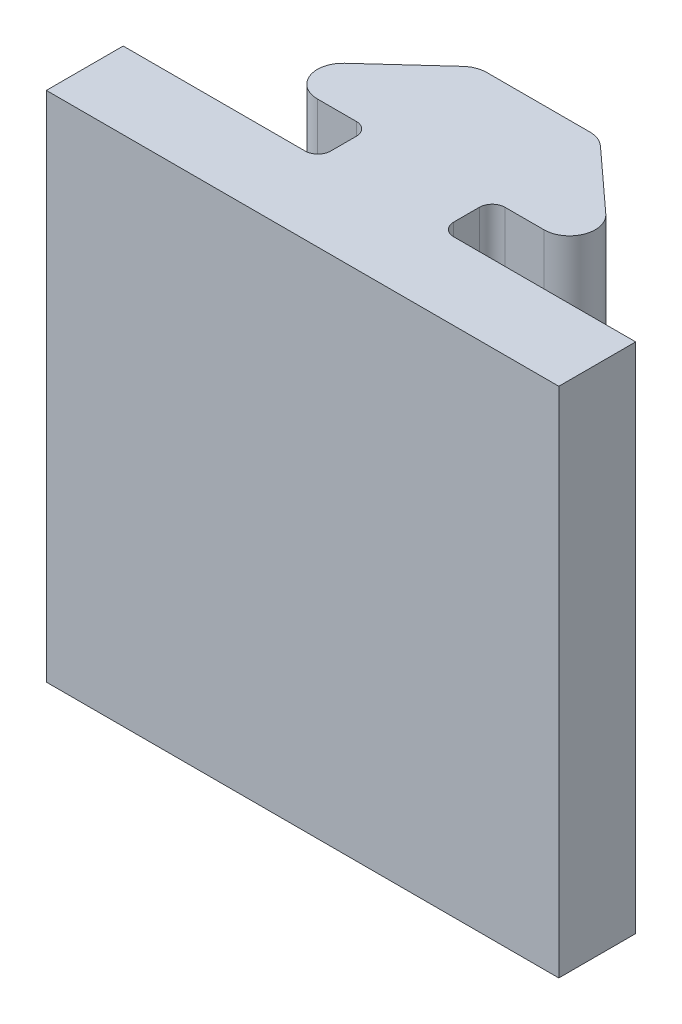
ISO-10303-21;
HEADER;
FILE_DESCRIPTION(('STEP AP214'),'2;1');
FILE_NAME('part.step','',(''),(''),'','','');
FILE_SCHEMA(('AUTOMOTIVE_DESIGN { 1 0 10303 214 1 1 1 1 }'));
ENDSEC;
DATA;
#1=APPLICATION_CONTEXT('core data for automotive mechanical design processes');
#2=APPLICATION_PROTOCOL_DEFINITION('international standard','automotive_design',2000,#1);
#3=PRODUCT_CONTEXT('',#1,'mechanical');
#4=PRODUCT('Part','Part','',(#3));
#5=PRODUCT_RELATED_PRODUCT_CATEGORY('part','',(#4));
#6=PRODUCT_DEFINITION_FORMATION('','',#4);
#7=PRODUCT_DEFINITION_CONTEXT('part definition',#1,'design');
#8=PRODUCT_DEFINITION('design','',#6,#7);
#9=PRODUCT_DEFINITION_SHAPE('','',#8);
#10=(LENGTH_UNIT() NAMED_UNIT(*) SI_UNIT(.MILLI.,.METRE.));
#11=(NAMED_UNIT(*) PLANE_ANGLE_UNIT() SI_UNIT($,.RADIAN.));
#12=(NAMED_UNIT(*) SI_UNIT($,.STERADIAN.) SOLID_ANGLE_UNIT());
#13=UNCERTAINTY_MEASURE_WITH_UNIT(LENGTH_MEASURE(1.E-05),#10,'distance_accuracy_value','');
#14=(GEOMETRIC_REPRESENTATION_CONTEXT(3) GLOBAL_UNCERTAINTY_ASSIGNED_CONTEXT((#13)) GLOBAL_UNIT_ASSIGNED_CONTEXT((#10,
#11,#12)) REPRESENTATION_CONTEXT('',''));
#15=CARTESIAN_POINT('',(0.,0.,0.));
#16=DIRECTION('',(0.,0.,1.));
#17=DIRECTION('',(1.,0.,0.));
#18=AXIS2_PLACEMENT_3D('',#15,#16,#17);
#19=CARTESIAN_POINT('',(2.4,20.,-4.58181818181819));
#20=DIRECTION('',(-0.674269364021332,0.,0.738485493928126));
#21=DIRECTION('',(0.738485493928126,0.,0.674269364021332));
#22=AXIS2_PLACEMENT_3D('',#19,#20,#21);
#23=PLANE('',#22);
#24=DIRECTION('',(-0.738485493928126,0.,-0.674269364021332));
#25=VECTOR('',#24,1.);
#26=CARTESIAN_POINT('',(2.4,0.,-4.58181818181819));
#27=LINE('',#26,#25);
#28=CARTESIAN_POINT('',(5.0959444590311,0.,-2.12030367574631));
#29=VERTEX_POINT('',#28);
#30=CARTESIAN_POINT('',(2.68642064950729,0.,-4.32030367574631));
#31=VERTEX_POINT('',#30);
#32=EDGE_CURVE('E213',#29,#31,#27,.T.);
#33=ORIENTED_EDGE('',*,*,#32,.T.);
#34=DIRECTION('',(0.,-1.,0.));
#35=VECTOR('',#34,1.);
#36=CARTESIAN_POINT('',(2.68642064950729,20.,-4.32030367574631));
#37=LINE('',#36,#35);
#38=CARTESIAN_POINT('',(2.68642064950729,20.,-4.32030367574631));
#39=VERTEX_POINT('',#38);
#40=EDGE_CURVE('E265',#31,#39,#37,.F.);
#41=ORIENTED_EDGE('',*,*,#40,.T.);
#42=DIRECTION('',(-0.738485493928126,0.,-0.674269364021332));
#43=VECTOR('',#42,1.);
#44=CARTESIAN_POINT('',(2.4,20.,-4.58181818181819));
#45=LINE('',#44,#43);
#46=CARTESIAN_POINT('',(5.0959444590311,20.,-2.12030367574631));
#47=VERTEX_POINT('',#46);
#48=EDGE_CURVE('E242',#47,#39,#45,.T.);
#49=ORIENTED_EDGE('',*,*,#48,.F.);
#50=DIRECTION('',(0.,-1.,0.));
#51=VECTOR('',#50,1.);
#52=CARTESIAN_POINT('',(5.0959444590311,20.,-2.12030367574631));
#53=LINE('',#52,#51);
#54=EDGE_CURVE('E262',#47,#29,#53,.T.);
#55=ORIENTED_EDGE('',*,*,#54,.T.);
#56=EDGE_LOOP('',(#33,#41,#49,#55));
#57=FACE_BOUND('',#56,.T.);
#58=ADVANCED_FACE('F33',(#57),#23,.F.);
#59=CARTESIAN_POINT('',(-2.4,20.,-4.58181818181819));
#60=DIRECTION('',(0.,0.,1.));
#61=DIRECTION('',(1.,0.,0.));
#62=AXIS2_PLACEMENT_3D('',#59,#60,#61);
#63=PLANE('',#62);
#64=DIRECTION('',(-1.,0.,0.));
#65=VECTOR('',#64,1.);
#66=CARTESIAN_POINT('',(-2.4,20.,-4.58181818181819));
#67=LINE('',#66,#65);
#68=CARTESIAN_POINT('',(2.01215128548596,20.,-4.58181818181819));
#69=VERTEX_POINT('',#68);
#70=CARTESIAN_POINT('',(-2.01215128548596,20.,-4.58181818181819));
#71=VERTEX_POINT('',#70);
#72=EDGE_CURVE('E387',#69,#71,#67,.T.);
#73=ORIENTED_EDGE('',*,*,#72,.F.);
#74=DIRECTION('',(0.,-1.,0.));
#75=VECTOR('',#74,1.);
#76=CARTESIAN_POINT('',(2.01215128548596,20.,-4.58181818181819));
#77=LINE('',#76,#75);
#78=CARTESIAN_POINT('',(2.01215128548596,0.,-4.58181818181819));
#79=VERTEX_POINT('',#78);
#80=EDGE_CURVE('E250',#69,#79,#77,.T.);
#81=ORIENTED_EDGE('',*,*,#80,.T.);
#82=DIRECTION('',(-1.,0.,0.));
#83=VECTOR('',#82,1.);
#84=CARTESIAN_POINT('',(-2.4,0.,-4.58181818181819));
#85=LINE('',#84,#83);
#86=CARTESIAN_POINT('',(-2.01215128548596,0.,-4.58181818181819));
#87=VERTEX_POINT('',#86);
#88=EDGE_CURVE('E216',#79,#87,#85,.T.);
#89=ORIENTED_EDGE('',*,*,#88,.T.);
#90=DIRECTION('',(0.,-1.,0.));
#91=VECTOR('',#90,1.);
#92=CARTESIAN_POINT('',(-2.01215128548596,20.,-4.58181818181819));
#93=LINE('',#92,#91);
#94=EDGE_CURVE('E191',#87,#71,#93,.F.);
#95=ORIENTED_EDGE('',*,*,#94,.T.);
#96=EDGE_LOOP('',(#73,#81,#89,#95));
#97=FACE_BOUND('',#96,.T.);
#98=ADVANCED_FACE('F334',(#97),#63,.F.);
#99=CARTESIAN_POINT('',(-2.4,20.,-4.58181818181819));
#100=DIRECTION('',(0.674269364021332,0.,0.738485493928126));
#101=DIRECTION('',(0.738485493928126,0.,-0.674269364021332));
#102=AXIS2_PLACEMENT_3D('',#99,#100,#101);
#103=PLANE('',#102);
#104=DIRECTION('',(-0.738485493928126,0.,0.674269364021332));
#105=VECTOR('',#104,1.);
#106=CARTESIAN_POINT('',(-2.4,20.,-4.58181818181819));
#107=LINE('',#106,#105);
#108=CARTESIAN_POINT('',(-2.68642064950729,20.,-4.32030367574631));
#109=VERTEX_POINT('',#108);
#110=CARTESIAN_POINT('',(-5.0959444590311,20.,-2.12030367574631));
#111=VERTEX_POINT('',#110);
#112=EDGE_CURVE('E390',#109,#111,#107,.T.);
#113=ORIENTED_EDGE('',*,*,#112,.F.);
#114=DIRECTION('',(0.,-1.,0.));
#115=VECTOR('',#114,1.);
#116=CARTESIAN_POINT('',(-2.68642064950729,20.,-4.32030367574631));
#117=LINE('',#116,#115);
#118=CARTESIAN_POINT('',(-2.68642064950729,0.,-4.32030367574631));
#119=VERTEX_POINT('',#118);
#120=EDGE_CURVE('E277',#109,#119,#117,.T.);
#121=ORIENTED_EDGE('',*,*,#120,.T.);
#122=DIRECTION('',(-0.738485493928126,0.,0.674269364021332));
#123=VECTOR('',#122,1.);
#124=CARTESIAN_POINT('',(-2.4,0.,-4.58181818181819));
#125=LINE('',#124,#123);
#126=CARTESIAN_POINT('',(-5.0959444590311,0.,-2.12030367574631));
#127=VERTEX_POINT('',#126);
#128=EDGE_CURVE('E219',#119,#127,#125,.T.);
#129=ORIENTED_EDGE('',*,*,#128,.T.);
#130=DIRECTION('',(0.,-1.,0.));
#131=VECTOR('',#130,1.);
#132=CARTESIAN_POINT('',(-5.0959444590311,20.,-2.12030367574631));
#133=LINE('',#132,#131);
#134=EDGE_CURVE('E275',#127,#111,#133,.F.);
#135=ORIENTED_EDGE('',*,*,#134,.T.);
#136=EDGE_LOOP('',(#113,#121,#129,#135));
#137=FACE_BOUND('',#136,.T.);
#138=ADVANCED_FACE('F340',(#137),#103,.F.);
#139=CARTESIAN_POINT('',(-7.,20.,-0.381818181818188));
#140=DIRECTION('',(0.,0.,-1.));
#141=DIRECTION('',(-1.,0.,0.));
#142=AXIS2_PLACEMENT_3D('',#139,#140,#141);
#143=PLANE('',#142);
#144=DIRECTION('',(1.,0.,0.));
#145=VECTOR('',#144,1.);
#146=CARTESIAN_POINT('',(-7.,0.,-0.381818181818188));
#147=LINE('',#146,#145);
#148=CARTESIAN_POINT('',(-4.42167509500977,0.,-0.381818181818187));
#149=VERTEX_POINT('',#148);
#150=CARTESIAN_POINT('',(-2.9,0.,-0.381818181818187));
#151=VERTEX_POINT('',#150);
#152=EDGE_CURVE('E222',#149,#151,#147,.T.);
#153=ORIENTED_EDGE('',*,*,#152,.T.);
#154=DIRECTION('',(0.,-1.,0.));
#155=VECTOR('',#154,1.);
#156=CARTESIAN_POINT('',(-2.9,20.,-0.381818181818187));
#157=LINE('',#156,#155);
#158=CARTESIAN_POINT('',(-2.9,20.,-0.381818181818187));
#159=VERTEX_POINT('',#158);
#160=EDGE_CURVE('E54',#151,#159,#157,.F.);
#161=ORIENTED_EDGE('',*,*,#160,.T.);
#162=DIRECTION('',(1.,0.,0.));
#163=VECTOR('',#162,1.);
#164=CARTESIAN_POINT('',(-7.,20.,-0.381818181818188));
#165=LINE('',#164,#163);
#166=CARTESIAN_POINT('',(-4.42167509500977,20.,-0.381818181818187));
#167=VERTEX_POINT('',#166);
#168=EDGE_CURVE('E395',#167,#159,#165,.T.);
#169=ORIENTED_EDGE('',*,*,#168,.F.);
#170=DIRECTION('',(0.,-1.,0.));
#171=VECTOR('',#170,1.);
#172=CARTESIAN_POINT('',(-4.42167509500977,20.,-0.381818181818187));
#173=LINE('',#172,#171);
#174=EDGE_CURVE('E280',#167,#149,#173,.T.);
#175=ORIENTED_EDGE('',*,*,#174,.T.);
#176=EDGE_LOOP('',(#153,#161,#169,#175));
#177=FACE_BOUND('',#176,.T.);
#178=ADVANCED_FACE('F399',(#177),#143,.F.);
#179=CARTESIAN_POINT('',(-2.4,20.,-0.381818181818187));
#180=DIRECTION('',(1.,0.,0.));
#181=DIRECTION('',(0.,0.,-1.));
#182=AXIS2_PLACEMENT_3D('',#179,#180,#181);
#183=PLANE('',#182);
#184=DIRECTION('',(0.,0.,1.));
#185=VECTOR('',#184,1.);
#186=CARTESIAN_POINT('',(-2.4,0.,-0.381818181818187));
#187=LINE('',#186,#185);
#188=CARTESIAN_POINT('',(-2.4,0.,0.118181818181813));
#189=VERTEX_POINT('',#188);
#190=CARTESIAN_POINT('',(-2.4,0.,1.11818181818181));
#191=VERTEX_POINT('',#190);
#192=EDGE_CURVE('E224',#189,#191,#187,.T.);
#193=ORIENTED_EDGE('',*,*,#192,.T.);
#194=DIRECTION('',(0.,-1.,0.));
#195=VECTOR('',#194,1.);
#196=CARTESIAN_POINT('',(-2.4,20.,1.11818181818181));
#197=LINE('',#196,#195);
#198=CARTESIAN_POINT('',(-2.4,20.,1.11818181818181));
#199=VERTEX_POINT('',#198);
#200=EDGE_CURVE('E301',#191,#199,#197,.F.);
#201=ORIENTED_EDGE('',*,*,#200,.T.);
#202=DIRECTION('',(0.,0.,1.));
#203=VECTOR('',#202,1.);
#204=CARTESIAN_POINT('',(-2.4,20.,-0.381818181818187));
#205=LINE('',#204,#203);
#206=CARTESIAN_POINT('',(-2.4,20.,0.118181818181813));
#207=VERTEX_POINT('',#206);
#208=EDGE_CURVE('E182',#207,#199,#205,.T.);
#209=ORIENTED_EDGE('',*,*,#208,.F.);
#210=DIRECTION('',(0.,-1.,0.));
#211=VECTOR('',#210,1.);
#212=CARTESIAN_POINT('',(-2.4,0.,0.118181818181813));
#213=LINE('',#212,#211);
#214=EDGE_CURVE('E298',#207,#189,#213,.T.);
#215=ORIENTED_EDGE('',*,*,#214,.T.);
#216=EDGE_LOOP('',(#193,#201,#209,#215));
#217=FACE_BOUND('',#216,.T.);
#218=ADVANCED_FACE('F319',(#217),#183,.F.);
#219=CARTESIAN_POINT('',(-2.4,20.,1.61818181818181));
#220=DIRECTION('',(0.,0.,1.));
#221=DIRECTION('',(1.,0.,0.));
#222=AXIS2_PLACEMENT_3D('',#219,#220,#221);
#223=PLANE('',#222);
#224=DIRECTION('',(-1.,0.,0.));
#225=VECTOR('',#224,1.);
#226=CARTESIAN_POINT('',(-2.4,20.,1.61818181818181));
#227=LINE('',#226,#225);
#228=CARTESIAN_POINT('',(-2.9,20.,1.61818181818181));
#229=VERTEX_POINT('',#228);
#230=CARTESIAN_POINT('',(-10.,20.,1.61818181818181));
#231=VERTEX_POINT('',#230);
#232=EDGE_CURVE('E169',#229,#231,#227,.T.);
#233=ORIENTED_EDGE('',*,*,#232,.F.);
#234=DIRECTION('',(0.,-1.,0.));
#235=VECTOR('',#234,1.);
#236=CARTESIAN_POINT('',(-2.9,0.,1.61818181818181));
#237=LINE('',#236,#235);
#238=CARTESIAN_POINT('',(-2.9,0.,1.61818181818181));
#239=VERTEX_POINT('',#238);
#240=EDGE_CURVE('E296',#229,#239,#237,.T.);
#241=ORIENTED_EDGE('',*,*,#240,.T.);
#242=DIRECTION('',(-1.,0.,0.));
#243=VECTOR('',#242,1.);
#244=CARTESIAN_POINT('',(-2.4,0.,1.61818181818181));
#245=LINE('',#244,#243);
#246=CARTESIAN_POINT('',(-10.,0.,1.61818181818181));
#247=VERTEX_POINT('',#246);
#248=EDGE_CURVE('E188',#239,#247,#245,.T.);
#249=ORIENTED_EDGE('',*,*,#248,.T.);
#250=DIRECTION('',(0.,-1.,0.));
#251=VECTOR('',#250,1.);
#252=CARTESIAN_POINT('',(-10.,20.,1.61818181818181));
#253=LINE('',#252,#251);
#254=EDGE_CURVE('E185',#231,#247,#253,.T.);
#255=ORIENTED_EDGE('',*,*,#254,.F.);
#256=EDGE_LOOP('',(#233,#241,#249,#255));
#257=FACE_BOUND('',#256,.T.);
#258=ADVANCED_FACE('F186',(#257),#223,.F.);
#259=CARTESIAN_POINT('',(-10.,20.,1.61818181818181));
#260=DIRECTION('',(1.,0.,0.));
#261=DIRECTION('',(0.,0.,-1.));
#262=AXIS2_PLACEMENT_3D('',#259,#260,#261);
#263=PLANE('',#262);
#264=DIRECTION('',(0.,0.,1.));
#265=VECTOR('',#264,1.);
#266=CARTESIAN_POINT('',(-10.,0.,1.61818181818181));
#267=LINE('',#266,#265);
#268=CARTESIAN_POINT('',(-10.,0.,4.61818181818181));
#269=VERTEX_POINT('',#268);
#270=EDGE_CURVE('E228',#247,#269,#267,.T.);
#271=ORIENTED_EDGE('',*,*,#270,.T.);
#272=DIRECTION('',(0.,-1.,0.));
#273=VECTOR('',#272,1.);
#274=CARTESIAN_POINT('',(-10.,20.,4.61818181818181));
#275=LINE('',#274,#273);
#276=CARTESIAN_POINT('',(-10.,20.,4.61818181818181));
#277=VERTEX_POINT('',#276);
#278=EDGE_CURVE('E192',#277,#269,#275,.T.);
#279=ORIENTED_EDGE('',*,*,#278,.F.);
#280=DIRECTION('',(0.,0.,1.));
#281=VECTOR('',#280,1.);
#282=CARTESIAN_POINT('',(-10.,20.,1.61818181818181));
#283=LINE('',#282,#281);
#284=EDGE_CURVE('E174',#231,#277,#283,.T.);
#285=ORIENTED_EDGE('',*,*,#284,.F.);
#286=ORIENTED_EDGE('',*,*,#254,.T.);
#287=EDGE_LOOP('',(#271,#279,#285,#286));
#288=FACE_BOUND('',#287,.T.);
#289=ADVANCED_FACE('F194',(#288),#263,.F.);
#290=CARTESIAN_POINT('',(10.,20.,4.61818181818181));
#291=DIRECTION('',(0.,0.,-1.));
#292=DIRECTION('',(-1.,0.,0.));
#293=AXIS2_PLACEMENT_3D('',#290,#291,#292);
#294=PLANE('',#293);
#295=DIRECTION('',(1.,0.,0.));
#296=VECTOR('',#295,1.);
#297=CARTESIAN_POINT('',(10.,0.,4.61818181818181));
#298=LINE('',#297,#296);
#299=CARTESIAN_POINT('',(10.,0.,4.61818181818181));
#300=VERTEX_POINT('',#299);
#301=EDGE_CURVE('E230',#269,#300,#298,.T.);
#302=ORIENTED_EDGE('',*,*,#301,.T.);
#303=DIRECTION('',(0.,-1.,0.));
#304=VECTOR('',#303,1.);
#305=CARTESIAN_POINT('',(10.,20.,4.61818181818181));
#306=LINE('',#305,#304);
#307=CARTESIAN_POINT('',(10.,20.,4.61818181818181));
#308=VERTEX_POINT('',#307);
#309=EDGE_CURVE('E245',#308,#300,#306,.T.);
#310=ORIENTED_EDGE('',*,*,#309,.F.);
#311=DIRECTION('',(1.,0.,0.));
#312=VECTOR('',#311,1.);
#313=CARTESIAN_POINT('',(10.,20.,4.61818181818181));
#314=LINE('',#313,#312);
#315=EDGE_CURVE('E197',#277,#308,#314,.T.);
#316=ORIENTED_EDGE('',*,*,#315,.F.);
#317=ORIENTED_EDGE('',*,*,#278,.T.);
#318=EDGE_LOOP('',(#302,#310,#316,#317));
#319=FACE_BOUND('',#318,.T.);
#320=ADVANCED_FACE('F420',(#319),#294,.F.);
#321=CARTESIAN_POINT('',(10.,20.,1.61818181818181));
#322=DIRECTION('',(-1.,0.,0.));
#323=DIRECTION('',(0.,0.,1.));
#324=AXIS2_PLACEMENT_3D('',#321,#322,#323);
#325=PLANE('',#324);
#326=DIRECTION('',(0.,0.,-1.));
#327=VECTOR('',#326,1.);
#328=CARTESIAN_POINT('',(10.,0.,1.61818181818181));
#329=LINE('',#328,#327);
#330=CARTESIAN_POINT('',(10.,0.,1.61818181818181));
#331=VERTEX_POINT('',#330);
#332=EDGE_CURVE('E232',#300,#331,#329,.T.);
#333=ORIENTED_EDGE('',*,*,#332,.T.);
#334=DIRECTION('',(0.,-1.,0.));
#335=VECTOR('',#334,1.);
#336=CARTESIAN_POINT('',(10.,20.,1.61818181818181));
#337=LINE('',#336,#335);
#338=CARTESIAN_POINT('',(10.,20.,1.61818181818181));
#339=VERTEX_POINT('',#338);
#340=EDGE_CURVE('E212',#339,#331,#337,.T.);
#341=ORIENTED_EDGE('',*,*,#340,.F.);
#342=DIRECTION('',(0.,0.,-1.));
#343=VECTOR('',#342,1.);
#344=CARTESIAN_POINT('',(10.,20.,1.61818181818181));
#345=LINE('',#344,#343);
#346=EDGE_CURVE('E199',#308,#339,#345,.T.);
#347=ORIENTED_EDGE('',*,*,#346,.F.);
#348=ORIENTED_EDGE('',*,*,#309,.T.);
#349=EDGE_LOOP('',(#333,#341,#347,#348));
#350=FACE_BOUND('',#349,.T.);
#351=ADVANCED_FACE('F416',(#350),#325,.F.);
#352=CARTESIAN_POINT('',(2.4,20.,1.61818181818181));
#353=DIRECTION('',(0.,0.,1.));
#354=DIRECTION('',(1.,0.,0.));
#355=AXIS2_PLACEMENT_3D('',#352,#353,#354);
#356=PLANE('',#355);
#357=DIRECTION('',(-1.,0.,0.));
#358=VECTOR('',#357,1.);
#359=CARTESIAN_POINT('',(2.4,0.,1.61818181818181));
#360=LINE('',#359,#358);
#361=CARTESIAN_POINT('',(2.9,0.,1.61818181818181));
#362=VERTEX_POINT('',#361);
#363=EDGE_CURVE('E234',#331,#362,#360,.T.);
#364=ORIENTED_EDGE('',*,*,#363,.T.);
#365=DIRECTION('',(0.,-1.,0.));
#366=VECTOR('',#365,1.);
#367=CARTESIAN_POINT('',(2.9,20.,1.61818181818181));
#368=LINE('',#367,#366);
#369=CARTESIAN_POINT('',(2.9,20.,1.61818181818181));
#370=VERTEX_POINT('',#369);
#371=EDGE_CURVE('E291',#362,#370,#368,.F.);
#372=ORIENTED_EDGE('',*,*,#371,.T.);
#373=DIRECTION('',(-1.,0.,0.));
#374=VECTOR('',#373,1.);
#375=CARTESIAN_POINT('',(2.4,20.,1.61818181818181));
#376=LINE('',#375,#374);
#377=EDGE_CURVE('E204',#339,#370,#376,.T.);
#378=ORIENTED_EDGE('',*,*,#377,.F.);
#379=ORIENTED_EDGE('',*,*,#340,.T.);
#380=EDGE_LOOP('',(#364,#372,#378,#379));
#381=FACE_BOUND('',#380,.T.);
#382=ADVANCED_FACE('F412',(#381),#356,.F.);
#383=CARTESIAN_POINT('',(2.4,20.,-0.381818181818187));
#384=DIRECTION('',(-1.,0.,0.));
#385=DIRECTION('',(0.,0.,1.));
#386=AXIS2_PLACEMENT_3D('',#383,#384,#385);
#387=PLANE('',#386);
#388=DIRECTION('',(0.,0.,-1.));
#389=VECTOR('',#388,1.);
#390=CARTESIAN_POINT('',(2.4,20.,-0.381818181818187));
#391=LINE('',#390,#389);
#392=CARTESIAN_POINT('',(2.4,20.,1.11818181818181));
#393=VERTEX_POINT('',#392);
#394=CARTESIAN_POINT('',(2.4,20.,0.118181818181813));
#395=VERTEX_POINT('',#394);
#396=EDGE_CURVE('E207',#393,#395,#391,.T.);
#397=ORIENTED_EDGE('',*,*,#396,.F.);
#398=DIRECTION('',(0.,-1.,0.));
#399=VECTOR('',#398,1.);
#400=CARTESIAN_POINT('',(2.4,0.,1.11818181818181));
#401=LINE('',#400,#399);
#402=CARTESIAN_POINT('',(2.4,0.,1.11818181818181));
#403=VERTEX_POINT('',#402);
#404=EDGE_CURVE('E288',#393,#403,#401,.T.);
#405=ORIENTED_EDGE('',*,*,#404,.T.);
#406=DIRECTION('',(0.,0.,-1.));
#407=VECTOR('',#406,1.);
#408=CARTESIAN_POINT('',(2.4,0.,-0.381818181818187));
#409=LINE('',#408,#407);
#410=CARTESIAN_POINT('',(2.4,0.,0.118181818181813));
#411=VERTEX_POINT('',#410);
#412=EDGE_CURVE('E237',#403,#411,#409,.T.);
#413=ORIENTED_EDGE('',*,*,#412,.T.);
#414=DIRECTION('',(0.,-1.,0.));
#415=VECTOR('',#414,1.);
#416=CARTESIAN_POINT('',(2.4,20.,0.118181818181813));
#417=LINE('',#416,#415);
#418=EDGE_CURVE('E286',#411,#395,#417,.F.);
#419=ORIENTED_EDGE('',*,*,#418,.T.);
#420=EDGE_LOOP('',(#397,#405,#413,#419));
#421=FACE_BOUND('',#420,.T.);
#422=ADVANCED_FACE('F372',(#421),#387,.F.);
#423=CARTESIAN_POINT('',(7.,20.,-0.381818181818188));
#424=DIRECTION('',(0.,0.,-1.));
#425=DIRECTION('',(-1.,0.,0.));
#426=AXIS2_PLACEMENT_3D('',#423,#424,#425);
#427=PLANE('',#426);
#428=DIRECTION('',(1.,0.,0.));
#429=VECTOR('',#428,1.);
#430=CARTESIAN_POINT('',(7.,20.,-0.381818181818188));
#431=LINE('',#430,#429);
#432=CARTESIAN_POINT('',(2.9,20.,-0.381818181818187));
#433=VERTEX_POINT('',#432);
#434=CARTESIAN_POINT('',(4.42167509500977,20.,-0.381818181818187));
#435=VERTEX_POINT('',#434);
#436=EDGE_CURVE('E210',#433,#435,#431,.T.);
#437=ORIENTED_EDGE('',*,*,#436,.F.);
#438=DIRECTION('',(0.,-1.,0.));
#439=VECTOR('',#438,1.);
#440=CARTESIAN_POINT('',(2.9,0.,-0.381818181818187));
#441=LINE('',#440,#439);
#442=CARTESIAN_POINT('',(2.9,0.,-0.381818181818187));
#443=VERTEX_POINT('',#442);
#444=EDGE_CURVE('E293',#433,#443,#441,.T.);
#445=ORIENTED_EDGE('',*,*,#444,.T.);
#446=DIRECTION('',(1.,0.,0.));
#447=VECTOR('',#446,1.);
#448=CARTESIAN_POINT('',(7.,0.,-0.381818181818188));
#449=LINE('',#448,#447);
#450=CARTESIAN_POINT('',(4.42167509500977,0.,-0.381818181818187));
#451=VERTEX_POINT('',#450);
#452=EDGE_CURVE('E240',#443,#451,#449,.T.);
#453=ORIENTED_EDGE('',*,*,#452,.T.);
#454=DIRECTION('',(0.,-1.,0.));
#455=VECTOR('',#454,1.);
#456=CARTESIAN_POINT('',(4.42167509500977,20.,-0.381818181818187));
#457=LINE('',#456,#455);
#458=EDGE_CURVE('E283',#451,#435,#457,.F.);
#459=ORIENTED_EDGE('',*,*,#458,.T.);
#460=EDGE_LOOP('',(#437,#445,#453,#459));
#461=FACE_BOUND('',#460,.T.);
#462=ADVANCED_FACE('F378',(#461),#427,.F.);
#463=CARTESIAN_POINT('',(0.,20.,0.));
#464=DIRECTION('',(0.,-1.,0.));
#465=DIRECTION('',(0.,0.,-1.));
#466=AXIS2_PLACEMENT_3D('',#463,#464,#465);
#467=PLANE('',#466);
#468=ORIENTED_EDGE('',*,*,#48,.T.);
#469=CARTESIAN_POINT('',(2.01215128548596,20.,-3.58181818181819));
#470=DIRECTION('',(0.,-1.,0.));
#471=DIRECTION('',(0.,0.,-1.));
#472=AXIS2_PLACEMENT_3D('',#469,#470,#471);
#473=CIRCLE('',#472,1.);
#474=EDGE_CURVE('E273',#39,#69,#473,.F.);
#475=ORIENTED_EDGE('',*,*,#474,.T.);
#476=ORIENTED_EDGE('',*,*,#72,.T.);
#477=CARTESIAN_POINT('',(-2.01215128548596,20.,-3.58181818181819));
#478=DIRECTION('',(0.,-1.,0.));
#479=DIRECTION('',(0.,0.,-1.));
#480=AXIS2_PLACEMENT_3D('',#477,#478,#479);
#481=CIRCLE('',#480,1.);
#482=EDGE_CURVE('E271',#71,#109,#481,.F.);
#483=ORIENTED_EDGE('',*,*,#482,.T.);
#484=ORIENTED_EDGE('',*,*,#112,.T.);
#485=CARTESIAN_POINT('',(-4.42167509500977,20.,-1.38181818181819));
#486=DIRECTION('',(0.,-1.,0.));
#487=DIRECTION('',(0.,0.,-1.));
#488=AXIS2_PLACEMENT_3D('',#485,#486,#487);
#489=CIRCLE('',#488,1.);
#490=EDGE_CURVE('E269',#111,#167,#489,.F.);
#491=ORIENTED_EDGE('',*,*,#490,.T.);
#492=ORIENTED_EDGE('',*,*,#168,.T.);
#493=CARTESIAN_POINT('',(-2.9,20.,0.118181818181813));
#494=DIRECTION('',(0.,-1.,0.));
#495=DIRECTION('',(0.,0.,-1.));
#496=AXIS2_PLACEMENT_3D('',#493,#494,#495);
#497=CIRCLE('',#496,0.5);
#498=EDGE_CURVE('E11',#159,#207,#497,.T.);
#499=ORIENTED_EDGE('',*,*,#498,.T.);
#500=ORIENTED_EDGE('',*,*,#208,.T.);
#501=CARTESIAN_POINT('',(-2.9,20.,1.11818181818181));
#502=DIRECTION('',(0.,-1.,0.));
#503=DIRECTION('',(0.,0.,-1.));
#504=AXIS2_PLACEMENT_3D('',#501,#502,#503);
#505=CIRCLE('',#504,0.5);
#506=EDGE_CURVE('E178',#199,#229,#505,.T.);
#507=ORIENTED_EDGE('',*,*,#506,.T.);
#508=ORIENTED_EDGE('',*,*,#232,.T.);
#509=ORIENTED_EDGE('',*,*,#284,.T.);
#510=ORIENTED_EDGE('',*,*,#315,.T.);
#511=ORIENTED_EDGE('',*,*,#346,.T.);
#512=ORIENTED_EDGE('',*,*,#377,.T.);
#513=CARTESIAN_POINT('',(2.9,20.,1.11818181818181));
#514=DIRECTION('',(0.,-1.,0.));
#515=DIRECTION('',(0.,0.,-1.));
#516=AXIS2_PLACEMENT_3D('',#513,#514,#515);
#517=CIRCLE('',#516,0.5);
#518=EDGE_CURVE('E306',#370,#393,#517,.T.);
#519=ORIENTED_EDGE('',*,*,#518,.T.);
#520=ORIENTED_EDGE('',*,*,#396,.T.);
#521=CARTESIAN_POINT('',(2.9,20.,0.118181818181813));
#522=DIRECTION('',(0.,-1.,0.));
#523=DIRECTION('',(0.,0.,-1.));
#524=AXIS2_PLACEMENT_3D('',#521,#522,#523);
#525=CIRCLE('',#524,0.5);
#526=EDGE_CURVE('E310',#395,#433,#525,.T.);
#527=ORIENTED_EDGE('',*,*,#526,.T.);
#528=ORIENTED_EDGE('',*,*,#436,.T.);
#529=CARTESIAN_POINT('',(4.42167509500977,20.,-1.38181818181819));
#530=DIRECTION('',(0.,-1.,0.));
#531=DIRECTION('',(0.,0.,-1.));
#532=AXIS2_PLACEMENT_3D('',#529,#530,#531);
#533=CIRCLE('',#532,1.);
#534=EDGE_CURVE('E267',#435,#47,#533,.F.);
#535=ORIENTED_EDGE('',*,*,#534,.T.);
#536=EDGE_LOOP('',(#468,#475,#476,#483,#484,#491,#492,#499,#500,#507,#508,#509,#510,#511,#512,
#519,#520,#527,#528,#535));
#537=FACE_BOUND('',#536,.T.);
#538=ADVANCED_FACE('F172',(#537),#467,.F.);
#539=CARTESIAN_POINT('',(0.,0.,0.));
#540=DIRECTION('',(0.,-1.,0.));
#541=DIRECTION('',(0.,0.,-1.));
#542=AXIS2_PLACEMENT_3D('',#539,#540,#541);
#543=PLANE('',#542);
#544=ORIENTED_EDGE('',*,*,#88,.F.);
#545=CARTESIAN_POINT('',(2.01215128548596,0.,-3.58181818181819));
#546=DIRECTION('',(0.,-1.,0.));
#547=DIRECTION('',(0.,0.,-1.));
#548=AXIS2_PLACEMENT_3D('',#545,#546,#547);
#549=CIRCLE('',#548,1.);
#550=EDGE_CURVE('E260',#79,#31,#549,.T.);
#551=ORIENTED_EDGE('',*,*,#550,.T.);
#552=ORIENTED_EDGE('',*,*,#32,.F.);
#553=CARTESIAN_POINT('',(4.42167509500977,0.,-1.38181818181819));
#554=DIRECTION('',(0.,-1.,0.));
#555=DIRECTION('',(0.,0.,-1.));
#556=AXIS2_PLACEMENT_3D('',#553,#554,#555);
#557=CIRCLE('',#556,1.);
#558=EDGE_CURVE('E253',#29,#451,#557,.T.);
#559=ORIENTED_EDGE('',*,*,#558,.T.);
#560=ORIENTED_EDGE('',*,*,#452,.F.);
#561=CARTESIAN_POINT('',(2.9,0.,0.118181818181813));
#562=DIRECTION('',(0.,-1.,0.));
#563=DIRECTION('',(0.,0.,-1.));
#564=AXIS2_PLACEMENT_3D('',#561,#562,#563);
#565=CIRCLE('',#564,0.5);
#566=EDGE_CURVE('E308',#443,#411,#565,.F.);
#567=ORIENTED_EDGE('',*,*,#566,.T.);
#568=ORIENTED_EDGE('',*,*,#412,.F.);
#569=CARTESIAN_POINT('',(2.9,0.,1.11818181818181));
#570=DIRECTION('',(0.,-1.,0.));
#571=DIRECTION('',(0.,0.,-1.));
#572=AXIS2_PLACEMENT_3D('',#569,#570,#571);
#573=CIRCLE('',#572,0.5);
#574=EDGE_CURVE('E304',#403,#362,#573,.F.);
#575=ORIENTED_EDGE('',*,*,#574,.T.);
#576=ORIENTED_EDGE('',*,*,#363,.F.);
#577=ORIENTED_EDGE('',*,*,#332,.F.);
#578=ORIENTED_EDGE('',*,*,#301,.F.);
#579=ORIENTED_EDGE('',*,*,#270,.F.);
#580=ORIENTED_EDGE('',*,*,#248,.F.);
#581=CARTESIAN_POINT('',(-2.9,0.,1.11818181818181));
#582=DIRECTION('',(0.,-1.,0.));
#583=DIRECTION('',(0.,0.,-1.));
#584=AXIS2_PLACEMENT_3D('',#581,#582,#583);
#585=CIRCLE('',#584,0.5);
#586=EDGE_CURVE('E312',#239,#191,#585,.F.);
#587=ORIENTED_EDGE('',*,*,#586,.T.);
#588=ORIENTED_EDGE('',*,*,#192,.F.);
#589=CARTESIAN_POINT('',(-2.9,0.,0.118181818181813));
#590=DIRECTION('',(0.,-1.,0.));
#591=DIRECTION('',(0.,0.,-1.));
#592=AXIS2_PLACEMENT_3D('',#589,#590,#591);
#593=CIRCLE('',#592,0.5);
#594=EDGE_CURVE('E41',#189,#151,#593,.F.);
#595=ORIENTED_EDGE('',*,*,#594,.T.);
#596=ORIENTED_EDGE('',*,*,#152,.F.);
#597=CARTESIAN_POINT('',(-4.42167509500977,0.,-1.38181818181819));
#598=DIRECTION('',(0.,-1.,0.));
#599=DIRECTION('',(0.,0.,-1.));
#600=AXIS2_PLACEMENT_3D('',#597,#598,#599);
#601=CIRCLE('',#600,1.);
#602=EDGE_CURVE('E256',#149,#127,#601,.T.);
#603=ORIENTED_EDGE('',*,*,#602,.T.);
#604=ORIENTED_EDGE('',*,*,#128,.F.);
#605=CARTESIAN_POINT('',(-2.01215128548596,0.,-3.58181818181819));
#606=DIRECTION('',(0.,-1.,0.));
#607=DIRECTION('',(0.,0.,-1.));
#608=AXIS2_PLACEMENT_3D('',#605,#606,#607);
#609=CIRCLE('',#608,1.);
#610=EDGE_CURVE('E258',#119,#87,#609,.T.);
#611=ORIENTED_EDGE('',*,*,#610,.T.);
#612=EDGE_LOOP('',(#544,#551,#552,#559,#560,#567,#568,#575,#576,#577,#578,#579,#580,#587,#588,
#595,#596,#603,#604,#611));
#613=FACE_BOUND('',#612,.T.);
#614=ADVANCED_FACE('F315',(#613),#543,.T.);
#615=CARTESIAN_POINT('',(2.01215128548596,20.,-3.58181818181819));
#616=DIRECTION('',(0.,-1.,0.));
#617=DIRECTION('',(0.,0.,-1.));
#618=AXIS2_PLACEMENT_3D('',#615,#616,#617);
#619=CYLINDRICAL_SURFACE('',#618,1.);
#620=ORIENTED_EDGE('',*,*,#474,.F.);
#621=ORIENTED_EDGE('',*,*,#40,.F.);
#622=ORIENTED_EDGE('',*,*,#550,.F.);
#623=ORIENTED_EDGE('',*,*,#80,.F.);
#624=EDGE_LOOP('',(#620,#621,#622,#623));
#625=FACE_BOUND('',#624,.T.);
#626=ADVANCED_FACE('F345',(#625),#619,.T.);
#627=CARTESIAN_POINT('',(-2.01215128548596,20.,-3.58181818181819));
#628=DIRECTION('',(0.,-1.,0.));
#629=DIRECTION('',(0.,0.,-1.));
#630=AXIS2_PLACEMENT_3D('',#627,#628,#629);
#631=CYLINDRICAL_SURFACE('',#630,1.);
#632=ORIENTED_EDGE('',*,*,#482,.F.);
#633=ORIENTED_EDGE('',*,*,#94,.F.);
#634=ORIENTED_EDGE('',*,*,#610,.F.);
#635=ORIENTED_EDGE('',*,*,#120,.F.);
#636=EDGE_LOOP('',(#632,#633,#634,#635));
#637=FACE_BOUND('',#636,.T.);
#638=ADVANCED_FACE('F348',(#637),#631,.T.);
#639=CARTESIAN_POINT('',(-4.42167509500977,20.,-1.38181818181819));
#640=DIRECTION('',(0.,-1.,0.));
#641=DIRECTION('',(0.,0.,-1.));
#642=AXIS2_PLACEMENT_3D('',#639,#640,#641);
#643=CYLINDRICAL_SURFACE('',#642,1.);
#644=ORIENTED_EDGE('',*,*,#490,.F.);
#645=ORIENTED_EDGE('',*,*,#134,.F.);
#646=ORIENTED_EDGE('',*,*,#602,.F.);
#647=ORIENTED_EDGE('',*,*,#174,.F.);
#648=EDGE_LOOP('',(#644,#645,#646,#647));
#649=FACE_BOUND('',#648,.T.);
#650=ADVANCED_FACE('F352',(#649),#643,.T.);
#651=CARTESIAN_POINT('',(4.42167509500977,20.,-1.38181818181819));
#652=DIRECTION('',(0.,-1.,0.));
#653=DIRECTION('',(0.,0.,-1.));
#654=AXIS2_PLACEMENT_3D('',#651,#652,#653);
#655=CYLINDRICAL_SURFACE('',#654,1.);
#656=ORIENTED_EDGE('',*,*,#534,.F.);
#657=ORIENTED_EDGE('',*,*,#458,.F.);
#658=ORIENTED_EDGE('',*,*,#558,.F.);
#659=ORIENTED_EDGE('',*,*,#54,.F.);
#660=EDGE_LOOP('',(#656,#657,#658,#659));
#661=FACE_BOUND('',#660,.T.);
#662=ADVANCED_FACE('F356',(#661),#655,.T.);
#663=CARTESIAN_POINT('',(2.9,20.,1.11818181818181));
#664=DIRECTION('',(0.,1.,0.));
#665=DIRECTION('',(0.,0.,1.));
#666=AXIS2_PLACEMENT_3D('',#663,#664,#665);
#667=CYLINDRICAL_SURFACE('',#666,0.5);
#668=ORIENTED_EDGE('',*,*,#518,.F.);
#669=ORIENTED_EDGE('',*,*,#371,.F.);
#670=ORIENTED_EDGE('',*,*,#574,.F.);
#671=ORIENTED_EDGE('',*,*,#404,.F.);
#672=EDGE_LOOP('',(#668,#669,#670,#671));
#673=FACE_BOUND('',#672,.T.);
#674=ADVANCED_FACE('F330',(#673),#667,.F.);
#675=CARTESIAN_POINT('',(2.9,20.,0.118181818181813));
#676=DIRECTION('',(0.,1.,0.));
#677=DIRECTION('',(0.,0.,1.));
#678=AXIS2_PLACEMENT_3D('',#675,#676,#677);
#679=CYLINDRICAL_SURFACE('',#678,0.5);
#680=ORIENTED_EDGE('',*,*,#526,.F.);
#681=ORIENTED_EDGE('',*,*,#418,.F.);
#682=ORIENTED_EDGE('',*,*,#566,.F.);
#683=ORIENTED_EDGE('',*,*,#444,.F.);
#684=EDGE_LOOP('',(#680,#681,#682,#683));
#685=FACE_BOUND('',#684,.T.);
#686=ADVANCED_FACE('F324',(#685),#679,.F.);
#687=CARTESIAN_POINT('',(-2.9,20.,1.11818181818181));
#688=DIRECTION('',(0.,1.,0.));
#689=DIRECTION('',(0.,0.,1.));
#690=AXIS2_PLACEMENT_3D('',#687,#688,#689);
#691=CYLINDRICAL_SURFACE('',#690,0.5);
#692=ORIENTED_EDGE('',*,*,#506,.F.);
#693=ORIENTED_EDGE('',*,*,#200,.F.);
#694=ORIENTED_EDGE('',*,*,#586,.F.);
#695=ORIENTED_EDGE('',*,*,#240,.F.);
#696=EDGE_LOOP('',(#692,#693,#694,#695));
#697=FACE_BOUND('',#696,.T.);
#698=ADVANCED_FACE('F322',(#697),#691,.F.);
#699=CARTESIAN_POINT('',(-2.9,20.,0.118181818181813));
#700=DIRECTION('',(0.,1.,0.));
#701=DIRECTION('',(0.,0.,1.));
#702=AXIS2_PLACEMENT_3D('',#699,#700,#701);
#703=CYLINDRICAL_SURFACE('',#702,0.5);
#704=ORIENTED_EDGE('',*,*,#498,.F.);
#705=ORIENTED_EDGE('',*,*,#160,.F.);
#706=ORIENTED_EDGE('',*,*,#594,.F.);
#707=ORIENTED_EDGE('',*,*,#214,.F.);
#708=EDGE_LOOP('',(#704,#705,#706,#707));
#709=FACE_BOUND('',#708,.T.);
#710=ADVANCED_FACE('F35',(#709),#703,.F.);
#711=CLOSED_SHELL('',(#58,#98,#138,#178,#218,#258,#289,#320,#351,#382,#422,#462,#538,#614,#626,
#638,#650,#662,#674,#686,#698,#710));
#712=MANIFOLD_SOLID_BREP('B2',#711);
#713=ADVANCED_BREP_SHAPE_REPRESENTATION('',(#18,#712),#14);
#714=SHAPE_DEFINITION_REPRESENTATION(#9,#713);
ENDSEC;
END-ISO-10303-21;
